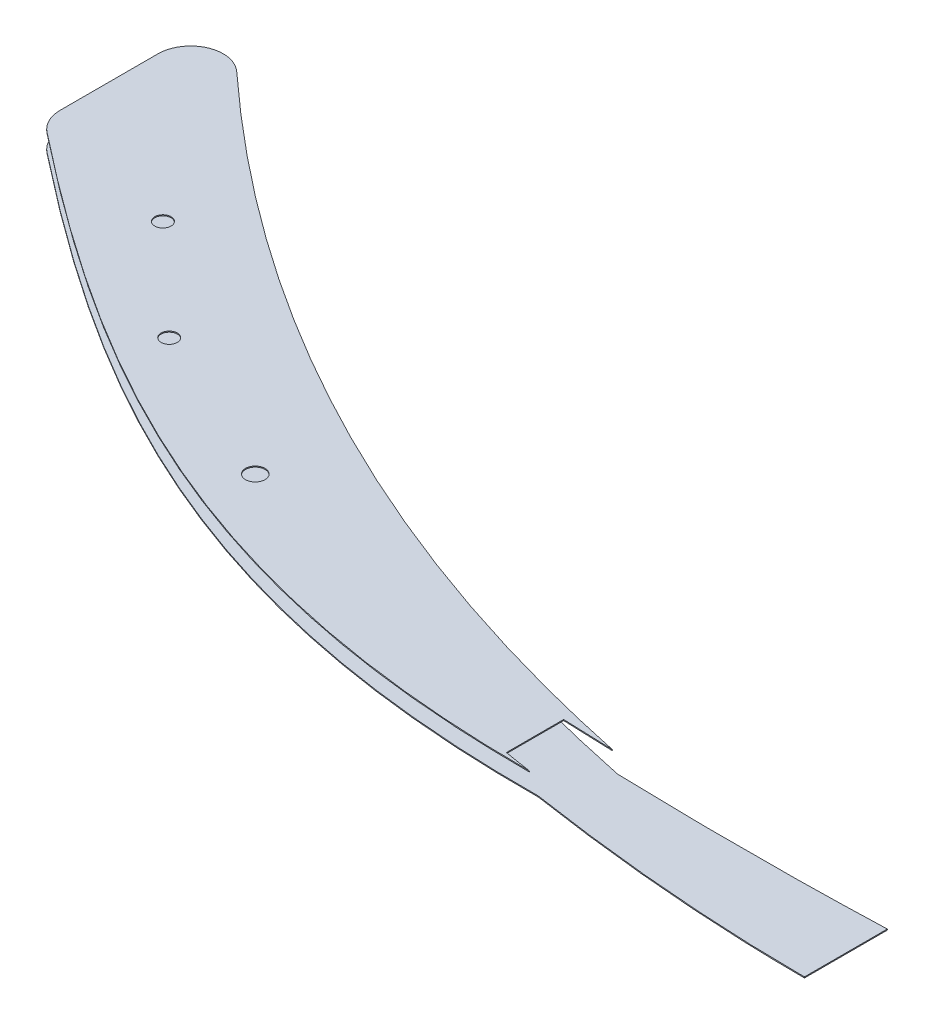
ISO-10303-21;
HEADER;
FILE_DESCRIPTION(('STEP AP214'),'2;1');
FILE_NAME('part.step','',(''),(''),'','','');
FILE_SCHEMA(('AUTOMOTIVE_DESIGN { 1 0 10303 214 1 1 1 1 }'));
ENDSEC;
DATA;
#1=APPLICATION_CONTEXT('core data for automotive mechanical design processes');
#2=APPLICATION_PROTOCOL_DEFINITION('international standard','automotive_design',2000,#1);
#3=PRODUCT_CONTEXT('',#1,'mechanical');
#4=PRODUCT('Part','Part','',(#3));
#5=PRODUCT_RELATED_PRODUCT_CATEGORY('part','',(#4));
#6=PRODUCT_DEFINITION_FORMATION('','',#4);
#7=PRODUCT_DEFINITION_CONTEXT('part definition',#1,'design');
#8=PRODUCT_DEFINITION('design','',#6,#7);
#9=PRODUCT_DEFINITION_SHAPE('','',#8);
#10=(LENGTH_UNIT() NAMED_UNIT(*) SI_UNIT(.MILLI.,.METRE.));
#11=(NAMED_UNIT(*) PLANE_ANGLE_UNIT() SI_UNIT($,.RADIAN.));
#12=(NAMED_UNIT(*) SI_UNIT($,.STERADIAN.) SOLID_ANGLE_UNIT());
#13=UNCERTAINTY_MEASURE_WITH_UNIT(LENGTH_MEASURE(1.E-05),#10,'distance_accuracy_value','');
#14=(GEOMETRIC_REPRESENTATION_CONTEXT(3) GLOBAL_UNCERTAINTY_ASSIGNED_CONTEXT((#13)) GLOBAL_UNIT_ASSIGNED_CONTEXT((#10,
#11,#12)) REPRESENTATION_CONTEXT('',''));
#15=CARTESIAN_POINT('',(0.,0.,0.));
#16=DIRECTION('',(0.,0.,1.));
#17=DIRECTION('',(1.,0.,0.));
#18=AXIS2_PLACEMENT_3D('',#15,#16,#17);
#19=CARTESIAN_POINT('',(-399.451682503824,300.3,-386.496425626492));
#20=CARTESIAN_POINT('',(-331.649658003381,300.3,-324.043622454853));
#21=CARTESIAN_POINT('',(-251.845093079777,300.3,-282.915553356741));
#22=CARTESIAN_POINT('',(-161.60969154118,300.3,-263.964054369405));
#23=B_SPLINE_CURVE_WITH_KNOTS('',3,(#19,#20,#21,#22),.UNSPECIFIED.,.F.,.F.,(4,4),(0.,
0.857945261881802),.UNSPECIFIED.);
#24=DIRECTION('',(0.,-1.,0.));
#25=VECTOR('',#24,1.);
#26=SURFACE_OF_LINEAR_EXTRUSION('',#23,#25);
#27=CARTESIAN_POINT('',(-161.60969154118,300.,-263.964054369405));
#28=CARTESIAN_POINT('',(-251.845093079777,300.,-282.915553356741));
#29=CARTESIAN_POINT('',(-331.649658003381,300.,-324.043622454853));
#30=CARTESIAN_POINT('',(-399.451682503824,300.,-386.496425626492));
#31=B_SPLINE_CURVE_WITH_KNOTS('',3,(#27,#28,#29,#30),.UNSPECIFIED.,.F.,.F.,(4,4),(0.,
0.857945261881802),.UNSPECIFIED.);
#32=CARTESIAN_POINT('',(-399.451682503824,300.,-386.496425626493));
#33=VERTEX_POINT('',#32);
#34=CARTESIAN_POINT('',(-161.609691541186,300.,-263.964054369406));
#35=VERTEX_POINT('',#34);
#36=EDGE_CURVE('E302',#33,#35,#31,.F.);
#37=ORIENTED_EDGE('',*,*,#36,.F.);
#38=DIRECTION('',(0.,-1.,0.));
#39=VECTOR('',#38,1.);
#40=CARTESIAN_POINT('',(-399.451682503824,300.3,-386.496425626493));
#41=LINE('',#40,#39);
#42=CARTESIAN_POINT('',(-399.451682503824,300.3,-386.496425626493));
#43=VERTEX_POINT('',#42);
#44=EDGE_CURVE('E189',#43,#33,#41,.T.);
#45=ORIENTED_EDGE('',*,*,#44,.F.);
#46=CARTESIAN_POINT('',(-399.451682503824,300.3,-386.496425626492));
#47=CARTESIAN_POINT('',(-331.649658003381,300.3,-324.043622454853));
#48=CARTESIAN_POINT('',(-251.845093079777,300.3,-282.915553356741));
#49=CARTESIAN_POINT('',(-161.60969154118,300.3,-263.964054369405));
#50=B_SPLINE_CURVE_WITH_KNOTS('',3,(#46,#47,#48,#49),.UNSPECIFIED.,.F.,.F.,(4,4),(0.,
0.857945261881802),.UNSPECIFIED.);
#51=CARTESIAN_POINT('',(-161.609691541186,300.3,-263.964054369406));
#52=VERTEX_POINT('',#51);
#53=EDGE_CURVE('E274',#43,#52,#50,.T.);
#54=ORIENTED_EDGE('',*,*,#53,.T.);
#55=DIRECTION('',(0.,-1.,0.));
#56=VECTOR('',#55,1.);
#57=CARTESIAN_POINT('',(-161.609691541186,300.3,-263.964054369406));
#58=LINE('',#57,#56);
#59=EDGE_CURVE('E12',#52,#35,#58,.T.);
#60=ORIENTED_EDGE('',*,*,#59,.T.);
#61=EDGE_LOOP('',(#37,#45,#54,#60));
#62=FACE_BOUND('',#61,.T.);
#63=ADVANCED_FACE('F47',(#62),#26,.T.);
#64=CARTESIAN_POINT('',(-161.609691541186,300.3,-263.964054369406));
#65=CARTESIAN_POINT('',(-163.461784935838,300.3,-264.018551283324));
#66=CARTESIAN_POINT('',(-167.684740985381,300.3,-264.151245151058));
#67=CARTESIAN_POINT('',(-172.876910079493,300.3,-264.337762118416));
#68=CARTESIAN_POINT('',(-176.217014144586,300.3,-264.469751133429));
#69=CARTESIAN_POINT('',(-177.187477809245,300.3,-264.509119585318));
#70=B_SPLINE_CURVE_WITH_KNOTS('',3,(#64,#65,#66,#67,#68,#69),.UNSPECIFIED.,.F.,.F.,(4,1,1,4),
(0.455950291136743,0.480354949034344,0.511604949034344,0.524404657897601),.UNSPECIFIED.);
#71=DIRECTION('',(0.,-1.,0.));
#72=VECTOR('',#71,1.);
#73=SURFACE_OF_LINEAR_EXTRUSION('',#70,#72);
#74=CARTESIAN_POINT('',(-177.187477809245,300.,-264.509119585318));
#75=CARTESIAN_POINT('',(-176.217014144586,300.,-264.469751133429));
#76=CARTESIAN_POINT('',(-172.876910079493,300.,-264.337762118416));
#77=CARTESIAN_POINT('',(-167.684740985381,300.,-264.151245151058));
#78=CARTESIAN_POINT('',(-163.461784935838,300.,-264.018551283324));
#79=CARTESIAN_POINT('',(-161.609691541186,300.,-263.964054369406));
#80=B_SPLINE_CURVE_WITH_KNOTS('',3,(#74,#75,#76,#77,#78,#79),.UNSPECIFIED.,.F.,.F.,(4,1,1,4),
(0.455950291136743,0.46875,0.5,0.524404657897601),.UNSPECIFIED.);
#81=CARTESIAN_POINT('',(-177.187477809245,300.,-264.509119585318));
#82=VERTEX_POINT('',#81);
#83=EDGE_CURVE('E259',#35,#82,#80,.F.);
#84=ORIENTED_EDGE('',*,*,#83,.F.);
#85=ORIENTED_EDGE('',*,*,#59,.F.);
#86=CARTESIAN_POINT('',(-161.609691541186,300.3,-263.964054369406));
#87=CARTESIAN_POINT('',(-163.461784935838,300.3,-264.018551283324));
#88=CARTESIAN_POINT('',(-167.684740985381,300.3,-264.151245151058));
#89=CARTESIAN_POINT('',(-172.876910079493,300.3,-264.337762118416));
#90=CARTESIAN_POINT('',(-176.217014144586,300.3,-264.469751133429));
#91=CARTESIAN_POINT('',(-177.187477809245,300.3,-264.509119585318));
#92=B_SPLINE_CURVE_WITH_KNOTS('',3,(#86,#87,#88,#89,#90,#91),.UNSPECIFIED.,.F.,.F.,(4,1,1,4),
(0.455950291136743,0.480354949034344,0.511604949034344,0.524404657897601),.UNSPECIFIED.);
#93=CARTESIAN_POINT('',(-177.187477809245,300.3,-264.509119585318));
#94=VERTEX_POINT('',#93);
#95=EDGE_CURVE('E105',#52,#94,#92,.T.);
#96=ORIENTED_EDGE('',*,*,#95,.T.);
#97=DIRECTION('',(0.,-1.,0.));
#98=VECTOR('',#97,1.);
#99=CARTESIAN_POINT('',(-177.187477809245,300.3,-264.509119585318));
#100=LINE('',#99,#98);
#101=EDGE_CURVE('E58',#94,#82,#100,.T.);
#102=ORIENTED_EDGE('',*,*,#101,.T.);
#103=EDGE_LOOP('',(#84,#85,#96,#102));
#104=FACE_BOUND('',#103,.T.);
#105=ADVANCED_FACE('F235',(#104),#73,.T.);
#106=CARTESIAN_POINT('',(-177.187477809245,300.3,-264.509119585318));
#107=DIRECTION('',(-1.,0.,0.));
#108=DIRECTION('',(0.,0.,-1.));
#109=AXIS2_PLACEMENT_3D('',#106,#107,#108);
#110=PLANE('',#109);
#111=DIRECTION('',(0.,0.,1.));
#112=VECTOR('',#111,1.);
#113=CARTESIAN_POINT('',(-177.187477809245,300.,-264.509119585318));
#114=LINE('',#113,#112);
#115=CARTESIAN_POINT('',(-177.187477809245,300.,-246.945846167666));
#116=VERTEX_POINT('',#115);
#117=EDGE_CURVE('E263',#82,#116,#114,.T.);
#118=ORIENTED_EDGE('',*,*,#117,.F.);
#119=ORIENTED_EDGE('',*,*,#101,.F.);
#120=DIRECTION('',(0.,0.,1.));
#121=VECTOR('',#120,1.);
#122=CARTESIAN_POINT('',(-177.187477809245,300.3,-264.509119585318));
#123=LINE('',#122,#121);
#124=CARTESIAN_POINT('',(-177.187477809245,300.3,-246.945846167666));
#125=VERTEX_POINT('',#124);
#126=EDGE_CURVE('E459',#94,#125,#123,.T.);
#127=ORIENTED_EDGE('',*,*,#126,.T.);
#128=DIRECTION('',(0.,-1.,0.));
#129=VECTOR('',#128,1.);
#130=CARTESIAN_POINT('',(-177.187477809245,300.3,-246.945846167666));
#131=LINE('',#130,#129);
#132=EDGE_CURVE('E191',#125,#116,#131,.T.);
#133=ORIENTED_EDGE('',*,*,#132,.T.);
#134=EDGE_LOOP('',(#118,#119,#127,#133));
#135=FACE_BOUND('',#134,.T.);
#136=ADVANCED_FACE('F243',(#135),#110,.F.);
#137=CARTESIAN_POINT('',(-62.2203477872149,300.3,-937.449704542469));
#138=DIRECTION('',(0.,-1.,0.));
#139=DIRECTION('',(0.,0.,1.));
#140=AXIS2_PLACEMENT_3D('',#137,#138,#139);
#141=CYLINDRICAL_SURFACE('',#140,700.00929952108);
#142=CARTESIAN_POINT('',(-62.2203477872149,300.,-937.449704542469));
#143=DIRECTION('',(0.,1.,0.));
#144=DIRECTION('',(0.,0.,-1.));
#145=AXIS2_PLACEMENT_3D('',#142,#143,#144);
#146=CIRCLE('',#145,700.00929952108);
#147=CARTESIAN_POINT('',(-168.766510620738,300.,-245.596443654407));
#148=VERTEX_POINT('',#147);
#149=EDGE_CURVE('E270',#116,#148,#146,.T.);
#150=ORIENTED_EDGE('',*,*,#149,.F.);
#151=ORIENTED_EDGE('',*,*,#132,.F.);
#152=CARTESIAN_POINT('',(-62.2203477872149,300.3,-937.449704542469));
#153=DIRECTION('',(0.,1.,0.));
#154=DIRECTION('',(0.,0.,-1.));
#155=AXIS2_PLACEMENT_3D('',#152,#153,#154);
#156=CIRCLE('',#155,700.00929952108);
#157=CARTESIAN_POINT('',(-168.766510620738,300.3,-245.596443654407));
#158=VERTEX_POINT('',#157);
#159=EDGE_CURVE('E142',#125,#158,#156,.T.);
#160=ORIENTED_EDGE('',*,*,#159,.T.);
#161=DIRECTION('',(0.,-1.,0.));
#162=VECTOR('',#161,1.);
#163=CARTESIAN_POINT('',(-168.766510620738,300.3,-245.596443654407));
#164=LINE('',#163,#162);
#165=EDGE_CURVE('E194',#158,#148,#164,.T.);
#166=ORIENTED_EDGE('',*,*,#165,.T.);
#167=EDGE_LOOP('',(#150,#151,#160,#166));
#168=FACE_BOUND('',#167,.T.);
#169=ADVANCED_FACE('F171',(#168),#141,.F.);
#170=CARTESIAN_POINT('',(-168.766510620738,300.3,-245.596443654407));
#171=CARTESIAN_POINT('',(-269.905820359368,300.3,-245.400566452578));
#172=CARTESIAN_POINT('',(-338.225722808998,300.3,-282.722388214947));
#173=CARTESIAN_POINT('',(-412.421480502429,300.3,-341.273256936095));
#174=B_SPLINE_CURVE_WITH_KNOTS('',3,(#170,#171,#172,#173),.UNSPECIFIED.,.F.,.F.,(4,4),
(0.0849051691132969,0.984590409608373),.UNSPECIFIED.);
#175=DIRECTION('',(0.,-1.,0.));
#176=VECTOR('',#175,1.);
#177=SURFACE_OF_LINEAR_EXTRUSION('',#174,#176);
#178=CARTESIAN_POINT('',(-412.421480502429,300.,-341.273256936095));
#179=CARTESIAN_POINT('',(-338.225722808998,300.,-282.722388214947));
#180=CARTESIAN_POINT('',(-269.905820359368,300.,-245.400566452578));
#181=CARTESIAN_POINT('',(-168.766510620738,300.,-245.596443654407));
#182=B_SPLINE_CURVE_WITH_KNOTS('',3,(#178,#179,#180,#181),.UNSPECIFIED.,.F.,.F.,(4,4),
(0.0849051691132969,0.984590409608373),.UNSPECIFIED.);
#183=CARTESIAN_POINT('',(-412.421480502429,300.,-341.273256936095));
#184=VERTEX_POINT('',#183);
#185=EDGE_CURVE('E153',#148,#184,#182,.F.);
#186=ORIENTED_EDGE('',*,*,#185,.F.);
#187=ORIENTED_EDGE('',*,*,#165,.F.);
#188=CARTESIAN_POINT('',(-168.766510620738,300.3,-245.596443654407));
#189=CARTESIAN_POINT('',(-269.905820359368,300.3,-245.400566452578));
#190=CARTESIAN_POINT('',(-338.225722808998,300.3,-282.722388214947));
#191=CARTESIAN_POINT('',(-412.421480502429,300.3,-341.273256936095));
#192=B_SPLINE_CURVE_WITH_KNOTS('',3,(#188,#189,#190,#191),.UNSPECIFIED.,.F.,.F.,(4,4),
(0.0849051691132969,0.984590409608373),.UNSPECIFIED.);
#193=CARTESIAN_POINT('',(-412.421480502429,300.3,-341.273256936095));
#194=VERTEX_POINT('',#193);
#195=EDGE_CURVE('E140',#158,#194,#192,.T.);
#196=ORIENTED_EDGE('',*,*,#195,.T.);
#197=DIRECTION('',(0.,-1.,0.));
#198=VECTOR('',#197,1.);
#199=CARTESIAN_POINT('',(-412.421480502429,300.3,-341.273256936095));
#200=LINE('',#199,#198);
#201=EDGE_CURVE('E134',#194,#184,#200,.T.);
#202=ORIENTED_EDGE('',*,*,#201,.T.);
#203=EDGE_LOOP('',(#186,#187,#196,#202));
#204=FACE_BOUND('',#203,.T.);
#205=ADVANCED_FACE('F160',(#204),#177,.T.);
#206=CARTESIAN_POINT('',(-406.226649581238,300.3,-349.123356926404));
#207=DIRECTION('',(0.,-1.,0.));
#208=DIRECTION('',(0.,0.,1.));
#209=AXIS2_PLACEMENT_3D('',#206,#207,#208);
#210=CYLINDRICAL_SURFACE('',#209,9.99999999999995);
#211=CARTESIAN_POINT('',(-406.226649581238,300.,-349.123356926404));
#212=DIRECTION('',(0.,-1.,0.));
#213=DIRECTION('',(0.,0.,-1.));
#214=AXIS2_PLACEMENT_3D('',#211,#212,#213);
#215=CIRCLE('',#214,9.99999999999995);
#216=CARTESIAN_POINT('',(-416.226649581238,300.,-349.123356926403));
#217=VERTEX_POINT('',#216);
#218=EDGE_CURVE('E188',#184,#217,#215,.T.);
#219=ORIENTED_EDGE('',*,*,#218,.F.);
#220=ORIENTED_EDGE('',*,*,#201,.F.);
#221=CARTESIAN_POINT('',(-406.226649581238,300.3,-349.123356926404));
#222=DIRECTION('',(0.,-1.,0.));
#223=DIRECTION('',(0.,0.,-1.));
#224=AXIS2_PLACEMENT_3D('',#221,#222,#223);
#225=CIRCLE('',#224,9.99999999999995);
#226=CARTESIAN_POINT('',(-416.226649581238,300.3,-349.123356926403));
#227=VERTEX_POINT('',#226);
#228=EDGE_CURVE('E124',#194,#227,#225,.T.);
#229=ORIENTED_EDGE('',*,*,#228,.T.);
#230=DIRECTION('',(0.,-1.,0.));
#231=VECTOR('',#230,1.);
#232=CARTESIAN_POINT('',(-416.226649581238,300.3,-349.123356926403));
#233=LINE('',#232,#231);
#234=EDGE_CURVE('E129',#227,#217,#233,.T.);
#235=ORIENTED_EDGE('',*,*,#234,.T.);
#236=EDGE_LOOP('',(#219,#220,#229,#235));
#237=FACE_BOUND('',#236,.T.);
#238=ADVANCED_FACE('F137',(#237),#210,.T.);
#239=CARTESIAN_POINT('',(-416.226649581238,300.3,-349.123356926403));
#240=DIRECTION('',(1.,0.,0.));
#241=DIRECTION('',(0.,0.,1.));
#242=AXIS2_PLACEMENT_3D('',#239,#240,#241);
#243=PLANE('',#242);
#244=DIRECTION('',(0.,0.,-1.));
#245=VECTOR('',#244,1.);
#246=CARTESIAN_POINT('',(-416.226649581238,300.,-349.123356926403));
#247=LINE('',#246,#245);
#248=CARTESIAN_POINT('',(-416.226649581238,300.,-379.14116756848));
#249=VERTEX_POINT('',#248);
#250=EDGE_CURVE('E131',#217,#249,#247,.T.);
#251=ORIENTED_EDGE('',*,*,#250,.F.);
#252=ORIENTED_EDGE('',*,*,#234,.F.);
#253=DIRECTION('',(0.,0.,-1.));
#254=VECTOR('',#253,1.);
#255=CARTESIAN_POINT('',(-416.226649581238,300.3,-349.123356926403));
#256=LINE('',#255,#254);
#257=CARTESIAN_POINT('',(-416.226649581238,300.3,-379.14116756848));
#258=VERTEX_POINT('',#257);
#259=EDGE_CURVE('E120',#227,#258,#256,.T.);
#260=ORIENTED_EDGE('',*,*,#259,.T.);
#261=DIRECTION('',(0.,-1.,0.));
#262=VECTOR('',#261,1.);
#263=CARTESIAN_POINT('',(-416.226649581238,300.3,-379.14116756848));
#264=LINE('',#263,#262);
#265=EDGE_CURVE('E135',#258,#249,#264,.T.);
#266=ORIENTED_EDGE('',*,*,#265,.T.);
#267=EDGE_LOOP('',(#251,#252,#260,#266));
#268=FACE_BOUND('',#267,.T.);
#269=ADVANCED_FACE('F130',(#268),#243,.F.);
#270=CARTESIAN_POINT('',(-406.226649581238,300.3,-379.14116756848));
#271=DIRECTION('',(0.,-1.,0.));
#272=DIRECTION('',(0.,0.,1.));
#273=AXIS2_PLACEMENT_3D('',#270,#271,#272);
#274=CYLINDRICAL_SURFACE('',#273,10.);
#275=CARTESIAN_POINT('',(-406.226649581238,300.,-379.14116756848));
#276=DIRECTION('',(0.,-1.,0.));
#277=DIRECTION('',(0.,0.,-1.));
#278=AXIS2_PLACEMENT_3D('',#275,#276,#277);
#279=CIRCLE('',#278,10.);
#280=EDGE_CURVE('E93',#249,#33,#279,.T.);
#281=ORIENTED_EDGE('',*,*,#280,.F.);
#282=ORIENTED_EDGE('',*,*,#265,.F.);
#283=CARTESIAN_POINT('',(-406.226649581238,300.3,-379.14116756848));
#284=DIRECTION('',(0.,-1.,0.));
#285=DIRECTION('',(0.,0.,-1.));
#286=AXIS2_PLACEMENT_3D('',#283,#284,#285);
#287=CIRCLE('',#286,10.);
#288=EDGE_CURVE('E67',#258,#43,#287,.T.);
#289=ORIENTED_EDGE('',*,*,#288,.T.);
#290=ORIENTED_EDGE('',*,*,#44,.T.);
#291=EDGE_LOOP('',(#281,#282,#289,#290));
#292=FACE_BOUND('',#291,.T.);
#293=ADVANCED_FACE('F210',(#292),#274,.T.);
#294=CARTESIAN_POINT('',(-288.94320341181,300.3,-308.917250928835));
#295=DIRECTION('',(0.,1.,0.));
#296=DIRECTION('',(0.,0.,-1.));
#297=AXIS2_PLACEMENT_3D('',#294,#295,#296);
#298=PLANE('',#297);
#299=CARTESIAN_POINT('',(-370.956911026411,300.3,-335.367132453118));
#300=DIRECTION('',(0.,-1.,0.));
#301=DIRECTION('',(0.,0.,-1.));
#302=AXIS2_PLACEMENT_3D('',#299,#300,#301);
#303=CIRCLE('',#302,2.50000000000002);
#304=CARTESIAN_POINT('',(-370.956911026411,300.3,-337.867132453118));
#305=VERTEX_POINT('',#304);
#306=EDGE_CURVE('E326',#305,#305,#303,.T.);
#307=ORIENTED_EDGE('',*,*,#306,.T.);
#308=EDGE_LOOP('',(#307));
#309=FACE_BOUND('',#308,.T.);
#310=CARTESIAN_POINT('',(-339.082998520851,300.3,-305.429754445409));
#311=DIRECTION('',(0.,-1.,0.));
#312=DIRECTION('',(0.,0.,-1.));
#313=AXIS2_PLACEMENT_3D('',#310,#311,#312);
#314=CIRCLE('',#313,2.50000000000002);
#315=CARTESIAN_POINT('',(-339.082998520851,300.3,-307.929754445409));
#316=VERTEX_POINT('',#315);
#317=EDGE_CURVE('E419',#316,#316,#314,.T.);
#318=ORIENTED_EDGE('',*,*,#317,.T.);
#319=EDGE_LOOP('',(#318));
#320=FACE_BOUND('',#319,.T.);
#321=CARTESIAN_POINT('',(-289.687055909534,300.3,-282.424125212571));
#322=DIRECTION('',(0.,-1.,0.));
#323=DIRECTION('',(0.,0.,-1.));
#324=AXIS2_PLACEMENT_3D('',#321,#322,#323);
#325=CIRCLE('',#324,2.99999999999999);
#326=CARTESIAN_POINT('',(-289.687055909534,300.3,-285.424125212571));
#327=VERTEX_POINT('',#326);
#328=EDGE_CURVE('E422',#327,#327,#325,.T.);
#329=ORIENTED_EDGE('',*,*,#328,.T.);
#330=EDGE_LOOP('',(#329));
#331=FACE_BOUND('',#330,.T.);
#332=ORIENTED_EDGE('',*,*,#53,.F.);
#333=ORIENTED_EDGE('',*,*,#288,.F.);
#334=ORIENTED_EDGE('',*,*,#259,.F.);
#335=ORIENTED_EDGE('',*,*,#228,.F.);
#336=ORIENTED_EDGE('',*,*,#195,.F.);
#337=ORIENTED_EDGE('',*,*,#159,.F.);
#338=ORIENTED_EDGE('',*,*,#126,.F.);
#339=ORIENTED_EDGE('',*,*,#95,.F.);
#340=EDGE_LOOP('',(#332,#333,#334,#335,#336,#337,#338,#339));
#341=FACE_BOUND('',#340,.T.);
#342=ADVANCED_FACE('F122',(#309,#320,#331,#341),#298,.T.);
#343=CARTESIAN_POINT('',(-288.94320341181,300.,-308.917250928835));
#344=DIRECTION('',(0.,1.,0.));
#345=DIRECTION('',(0.,0.,-1.));
#346=AXIS2_PLACEMENT_3D('',#343,#344,#345);
#347=PLANE('',#346);
#348=CARTESIAN_POINT('',(-370.956911026411,300.,-335.367132453118));
#349=DIRECTION('',(0.,-1.,0.));
#350=DIRECTION('',(0.,0.,-1.));
#351=AXIS2_PLACEMENT_3D('',#348,#349,#350);
#352=CIRCLE('',#351,2.50000000000002);
#353=CARTESIAN_POINT('',(-370.956911026411,300.,-337.867132453118));
#354=VERTEX_POINT('',#353);
#355=EDGE_CURVE('E52',#354,#354,#352,.T.);
#356=ORIENTED_EDGE('',*,*,#355,.F.);
#357=EDGE_LOOP('',(#356));
#358=FACE_BOUND('',#357,.T.);
#359=CARTESIAN_POINT('',(-339.082998520851,300.,-305.429754445409));
#360=DIRECTION('',(0.,-1.,0.));
#361=DIRECTION('',(0.,0.,-1.));
#362=AXIS2_PLACEMENT_3D('',#359,#360,#361);
#363=CIRCLE('',#362,2.50000000000002);
#364=CARTESIAN_POINT('',(-339.082998520851,300.,-307.929754445409));
#365=VERTEX_POINT('',#364);
#366=EDGE_CURVE('E325',#365,#365,#363,.T.);
#367=ORIENTED_EDGE('',*,*,#366,.F.);
#368=EDGE_LOOP('',(#367));
#369=FACE_BOUND('',#368,.T.);
#370=CARTESIAN_POINT('',(-289.687055909534,300.,-282.424125212571));
#371=DIRECTION('',(0.,-1.,0.));
#372=DIRECTION('',(0.,0.,-1.));
#373=AXIS2_PLACEMENT_3D('',#370,#371,#372);
#374=CIRCLE('',#373,2.99999999999999);
#375=CARTESIAN_POINT('',(-289.687055909534,300.,-285.424125212571));
#376=VERTEX_POINT('',#375);
#377=EDGE_CURVE('E323',#376,#376,#374,.T.);
#378=ORIENTED_EDGE('',*,*,#377,.F.);
#379=EDGE_LOOP('',(#378));
#380=FACE_BOUND('',#379,.T.);
#381=ORIENTED_EDGE('',*,*,#36,.T.);
#382=ORIENTED_EDGE('',*,*,#83,.T.);
#383=ORIENTED_EDGE('',*,*,#117,.T.);
#384=ORIENTED_EDGE('',*,*,#149,.T.);
#385=ORIENTED_EDGE('',*,*,#185,.T.);
#386=ORIENTED_EDGE('',*,*,#218,.T.);
#387=ORIENTED_EDGE('',*,*,#250,.T.);
#388=ORIENTED_EDGE('',*,*,#280,.T.);
#389=EDGE_LOOP('',(#381,#382,#383,#384,#385,#386,#387,#388));
#390=FACE_BOUND('',#389,.T.);
#391=ADVANCED_FACE('F209',(#358,#369,#380,#390),#347,.F.);
#392=CARTESIAN_POINT('',(-289.687055909534,288.3,-282.424125212571));
#393=DIRECTION('',(0.,1.,0.));
#394=DIRECTION('',(0.,0.,-1.));
#395=AXIS2_PLACEMENT_3D('',#392,#393,#394);
#396=CYLINDRICAL_SURFACE('',#395,2.99999999999999);
#397=ORIENTED_EDGE('',*,*,#328,.F.);
#398=EDGE_LOOP('',(#397));
#399=FACE_BOUND('',#398,.T.);
#400=ORIENTED_EDGE('',*,*,#377,.T.);
#401=EDGE_LOOP('',(#400));
#402=FACE_BOUND('',#401,.T.);
#403=ADVANCED_FACE('F212',(#399,#402),#396,.F.);
#404=CARTESIAN_POINT('',(-339.082998520851,288.3,-305.429754445409));
#405=DIRECTION('',(0.,1.,0.));
#406=DIRECTION('',(0.,0.,-1.));
#407=AXIS2_PLACEMENT_3D('',#404,#405,#406);
#408=CYLINDRICAL_SURFACE('',#407,2.50000000000002);
#409=ORIENTED_EDGE('',*,*,#317,.F.);
#410=EDGE_LOOP('',(#409));
#411=FACE_BOUND('',#410,.T.);
#412=ORIENTED_EDGE('',*,*,#366,.T.);
#413=EDGE_LOOP('',(#412));
#414=FACE_BOUND('',#413,.T.);
#415=ADVANCED_FACE('F341',(#411,#414),#408,.F.);
#416=CARTESIAN_POINT('',(-370.956911026411,288.3,-335.367132453118));
#417=DIRECTION('',(0.,1.,0.));
#418=DIRECTION('',(0.,0.,-1.));
#419=AXIS2_PLACEMENT_3D('',#416,#417,#418);
#420=CYLINDRICAL_SURFACE('',#419,2.50000000000002);
#421=ORIENTED_EDGE('',*,*,#306,.F.);
#422=EDGE_LOOP('',(#421));
#423=FACE_BOUND('',#422,.T.);
#424=ORIENTED_EDGE('',*,*,#355,.T.);
#425=EDGE_LOOP('',(#424));
#426=FACE_BOUND('',#425,.T.);
#427=ADVANCED_FACE('F333',(#423,#426),#420,.F.);
#428=CLOSED_SHELL('',(#63,#105,#136,#169,#205,#238,#269,#293,#342,#391,#403,#415,#427));
#429=MANIFOLD_SOLID_BREP('B2',#428);
#430=CARTESIAN_POINT('',(-412.421480502429,294.7,-341.273256936095));
#431=CARTESIAN_POINT('',(-337.562441747407,294.7,-282.19896634327));
#432=CARTESIAN_POINT('',(-268.684783511191,294.7,-244.734978020227));
#433=CARTESIAN_POINT('',(-166.046176884714,294.7,-245.610703349975));
#434=B_SPLINE_CURVE_WITH_KNOTS('',3,(#430,#431,#432,#433),.UNSPECIFIED.,.F.,.F.,(4,4),
(0.0768623348601792,0.984590409608373),.UNSPECIFIED.);
#435=DIRECTION('',(0.,1.,0.));
#436=VECTOR('',#435,1.);
#437=SURFACE_OF_LINEAR_EXTRUSION('',#434,#436);
#438=CARTESIAN_POINT('',(-412.421480502429,295.,-341.273256936095));
#439=CARTESIAN_POINT('',(-337.562441747407,295.,-282.19896634327));
#440=CARTESIAN_POINT('',(-268.684783511191,295.,-244.734978020227));
#441=CARTESIAN_POINT('',(-166.046176884714,295.,-245.610703349975));
#442=B_SPLINE_CURVE_WITH_KNOTS('',3,(#438,#439,#440,#441),.UNSPECIFIED.,.F.,.F.,(4,4),
(0.0768623348601792,0.984590409608373),.UNSPECIFIED.);
#443=CARTESIAN_POINT('',(-412.421480502429,295.,-341.273256936095));
#444=VERTEX_POINT('',#443);
#445=CARTESIAN_POINT('',(-166.046176884714,295.,-245.610703349975));
#446=VERTEX_POINT('',#445);
#447=EDGE_CURVE('E749',#444,#446,#442,.T.);
#448=ORIENTED_EDGE('',*,*,#447,.F.);
#449=DIRECTION('',(0.,1.,0.));
#450=VECTOR('',#449,1.);
#451=CARTESIAN_POINT('',(-412.421480502429,294.7,-341.273256936095));
#452=LINE('',#451,#450);
#453=CARTESIAN_POINT('',(-412.421480502429,294.7,-341.273256936095));
#454=VERTEX_POINT('',#453);
#455=EDGE_CURVE('E602',#454,#444,#452,.T.);
#456=ORIENTED_EDGE('',*,*,#455,.F.);
#457=CARTESIAN_POINT('',(-166.046176884714,294.7,-245.610703349975));
#458=VERTEX_POINT('',#457);
#459=EDGE_CURVE('E608',#454,#458,#434,.T.);
#460=ORIENTED_EDGE('',*,*,#459,.T.);
#461=DIRECTION('',(0.,1.,0.));
#462=VECTOR('',#461,1.);
#463=CARTESIAN_POINT('',(-166.046176884714,294.7,-245.610703349975));
#464=LINE('',#463,#462);
#465=EDGE_CURVE('E45',#458,#446,#464,.T.);
#466=ORIENTED_EDGE('',*,*,#465,.T.);
#467=EDGE_LOOP('',(#448,#456,#460,#466));
#468=FACE_BOUND('',#467,.T.);
#469=ADVANCED_FACE('F499',(#468),#437,.T.);
#470=CARTESIAN_POINT('',(-166.046176884714,294.7,-245.610703349975));
#471=CARTESIAN_POINT('',(-158.691588185936,294.7,-244.479612696359));
#472=CARTESIAN_POINT('',(-151.319796635798,294.7,-243.468209687689));
#473=CARTESIAN_POINT('',(-136.557675167849,294.7,-241.699121011541));
#474=CARTESIAN_POINT('',(-129.16508875455,294.7,-240.940959884745));
#475=CARTESIAN_POINT('',(-114.354878372138,294.7,-239.699183418636));
#476=CARTESIAN_POINT('',(-106.937301857712,294.7,-239.215047721649));
#477=CARTESIAN_POINT('',(-95.7901021433856,294.7,-238.717306802063));
#478=CARTESIAN_POINT('',(-92.0700558776784,294.7,-238.589825858461));
#479=CARTESIAN_POINT('',(-84.6298578500282,294.7,-238.417469405935));
#480=CARTESIAN_POINT('',(-80.9090479891768,294.7,-238.372473535805));
#481=CARTESIAN_POINT('',(-77.187477809136,294.7,-238.371526152161));
#482=B_SPLINE_CURVE_WITH_KNOTS('',3,(#470,#471,#472,#473,#474,#475,#476,#477,#478,#479,#480,
#481),.UNSPECIFIED.,.F.,.F.,(4,2,2,2,2,4),(0.,0.25,0.5,0.75,0.875,1.),.UNSPECIFIED.);
#483=DIRECTION('',(0.,1.,0.));
#484=VECTOR('',#483,1.);
#485=SURFACE_OF_LINEAR_EXTRUSION('',#482,#484);
#486=CARTESIAN_POINT('',(-77.187477809136,295.,-238.371526152161));
#487=CARTESIAN_POINT('',(-80.9090479891768,295.,-238.372473535805));
#488=CARTESIAN_POINT('',(-84.6298578500282,295.,-238.417469405935));
#489=CARTESIAN_POINT('',(-92.0700558776784,295.,-238.589825858461));
#490=CARTESIAN_POINT('',(-95.7901021433856,295.,-238.717306802063));
#491=CARTESIAN_POINT('',(-106.937301857712,295.,-239.215047721649));
#492=CARTESIAN_POINT('',(-114.354878372138,295.,-239.699183418636));
#493=CARTESIAN_POINT('',(-129.16508875455,295.,-240.940959884745));
#494=CARTESIAN_POINT('',(-136.557675167849,295.,-241.699121011541));
#495=CARTESIAN_POINT('',(-151.319796635798,295.,-243.468209687689));
#496=CARTESIAN_POINT('',(-158.691588185936,295.,-244.479612696359));
#497=CARTESIAN_POINT('',(-166.046176884714,295.,-245.610703349975));
#498=B_SPLINE_CURVE_WITH_KNOTS('',3,(#486,#487,#488,#489,#490,#491,#492,#493,#494,#495,#496,
#497),.UNSPECIFIED.,.F.,.F.,(4,2,2,2,2,4),(0.,0.125,0.25,0.5,0.75,1.),.UNSPECIFIED.);
#499=CARTESIAN_POINT('',(-77.187477809136,295.,-238.371526152161));
#500=VERTEX_POINT('',#499);
#501=EDGE_CURVE('E719',#446,#500,#498,.F.);
#502=ORIENTED_EDGE('',*,*,#501,.F.);
#503=ORIENTED_EDGE('',*,*,#465,.F.);
#504=CARTESIAN_POINT('',(-166.046176884714,294.7,-245.610703349975));
#505=CARTESIAN_POINT('',(-158.691588185936,294.7,-244.479612696359));
#506=CARTESIAN_POINT('',(-151.319796635798,294.7,-243.468209687689));
#507=CARTESIAN_POINT('',(-136.557675167849,294.7,-241.699121011541));
#508=CARTESIAN_POINT('',(-129.16508875455,294.7,-240.940959884745));
#509=CARTESIAN_POINT('',(-114.354878372138,294.7,-239.699183418636));
#510=CARTESIAN_POINT('',(-106.937301857712,294.7,-239.215047721649));
#511=CARTESIAN_POINT('',(-95.7901021433856,294.7,-238.717306802063));
#512=CARTESIAN_POINT('',(-92.0700558776784,294.7,-238.589825858461));
#513=CARTESIAN_POINT('',(-84.6298578500282,294.7,-238.417469405935));
#514=CARTESIAN_POINT('',(-80.9090479891768,294.7,-238.372473535805));
#515=CARTESIAN_POINT('',(-77.187477809136,294.7,-238.371526152161));
#516=B_SPLINE_CURVE_WITH_KNOTS('',3,(#504,#505,#506,#507,#508,#509,#510,#511,#512,#513,#514,
#515),.UNSPECIFIED.,.F.,.F.,(4,2,2,2,2,4),(0.,0.25,0.5,0.75,0.875,1.),.UNSPECIFIED.);
#517=CARTESIAN_POINT('',(-77.187477809136,294.7,-238.371526152161));
#518=VERTEX_POINT('',#517);
#519=EDGE_CURVE('E556',#458,#518,#516,.T.);
#520=ORIENTED_EDGE('',*,*,#519,.T.);
#521=DIRECTION('',(0.,1.,0.));
#522=VECTOR('',#521,1.);
#523=CARTESIAN_POINT('',(-77.187477809136,294.7,-238.371526152161));
#524=LINE('',#523,#522);
#525=EDGE_CURVE('E509',#518,#500,#524,.T.);
#526=ORIENTED_EDGE('',*,*,#525,.T.);
#527=EDGE_LOOP('',(#502,#503,#520,#526));
#528=FACE_BOUND('',#527,.T.);
#529=ADVANCED_FACE('F654',(#528),#485,.T.);
#530=CARTESIAN_POINT('',(-77.1874778091361,294.7,-238.37152615216));
#531=DIRECTION('',(-1.,0.,0.));
#532=DIRECTION('',(0.,0.,-1.));
#533=AXIS2_PLACEMENT_3D('',#530,#531,#532);
#534=PLANE('',#533);
#535=DIRECTION('',(0.,0.,-1.));
#536=VECTOR('',#535,1.);
#537=CARTESIAN_POINT('',(-77.1874778091361,295.,-238.37152615216));
#538=LINE('',#537,#536);
#539=CARTESIAN_POINT('',(-77.187477809136,295.,-263.787467627316));
#540=VERTEX_POINT('',#539);
#541=EDGE_CURVE('E712',#500,#540,#538,.T.);
#542=ORIENTED_EDGE('',*,*,#541,.F.);
#543=ORIENTED_EDGE('',*,*,#525,.F.);
#544=DIRECTION('',(0.,0.,-1.));
#545=VECTOR('',#544,1.);
#546=CARTESIAN_POINT('',(-77.1874778091361,294.7,-238.37152615216));
#547=LINE('',#546,#545);
#548=CARTESIAN_POINT('',(-77.187477809136,294.7,-263.787467627316));
#549=VERTEX_POINT('',#548);
#550=EDGE_CURVE('E741',#518,#549,#547,.T.);
#551=ORIENTED_EDGE('',*,*,#550,.T.);
#552=DIRECTION('',(0.,1.,0.));
#553=VECTOR('',#552,1.);
#554=CARTESIAN_POINT('',(-77.187477809136,294.7,-263.787467627316));
#555=LINE('',#554,#553);
#556=EDGE_CURVE('E732',#549,#540,#555,.T.);
#557=ORIENTED_EDGE('',*,*,#556,.T.);
#558=EDGE_LOOP('',(#542,#543,#551,#557));
#559=FACE_BOUND('',#558,.T.);
#560=ADVANCED_FACE('F664',(#559),#534,.F.);
#561=CARTESIAN_POINT('',(-77.187477809136,294.7,-263.787467627316));
#562=CARTESIAN_POINT('',(-90.931891453586,294.7,-263.302665158087));
#563=CARTESIAN_POINT('',(-104.681952299398,294.7,-263.050489589005));
#564=CARTESIAN_POINT('',(-132.179761622917,294.7,-262.987125090098));
#565=CARTESIAN_POINT('',(-145.931371491931,294.7,-263.172070992793));
#566=CARTESIAN_POINT('',(-159.678350984095,294.7,-263.562143642599));
#567=B_SPLINE_CURVE_WITH_KNOTS('',3,(#561,#562,#563,#564,#565,#566),.UNSPECIFIED.,.F.,.F.,(4,2,
4),(0.,0.5,1.),.UNSPECIFIED.);
#568=DIRECTION('',(0.,1.,0.));
#569=VECTOR('',#568,1.);
#570=SURFACE_OF_LINEAR_EXTRUSION('',#567,#569);
#571=CARTESIAN_POINT('',(-159.678350984095,295.,-263.562143642599));
#572=CARTESIAN_POINT('',(-145.931371491931,295.,-263.172070992793));
#573=CARTESIAN_POINT('',(-132.179761622917,295.,-262.987125090098));
#574=CARTESIAN_POINT('',(-104.681952299398,295.,-263.050489589005));
#575=CARTESIAN_POINT('',(-90.931891453586,295.,-263.302665158087));
#576=CARTESIAN_POINT('',(-77.187477809136,295.,-263.787467627316));
#577=B_SPLINE_CURVE_WITH_KNOTS('',3,(#571,#572,#573,#574,#575,#576),.UNSPECIFIED.,.F.,.F.,(4,2,
4),(0.,0.5,1.),.UNSPECIFIED.);
#578=CARTESIAN_POINT('',(-159.678350984095,295.,-263.562143642599));
#579=VERTEX_POINT('',#578);
#580=EDGE_CURVE('E708',#540,#579,#577,.F.);
#581=ORIENTED_EDGE('',*,*,#580,.F.);
#582=ORIENTED_EDGE('',*,*,#556,.F.);
#583=CARTESIAN_POINT('',(-77.187477809136,294.7,-263.787467627316));
#584=CARTESIAN_POINT('',(-90.931891453586,294.7,-263.302665158087));
#585=CARTESIAN_POINT('',(-104.681952299398,294.7,-263.050489589005));
#586=CARTESIAN_POINT('',(-132.179761622917,294.7,-262.987125090098));
#587=CARTESIAN_POINT('',(-145.931371491931,294.7,-263.172070992793));
#588=CARTESIAN_POINT('',(-159.678350984095,294.7,-263.562143642599));
#589=B_SPLINE_CURVE_WITH_KNOTS('',3,(#583,#584,#585,#586,#587,#588),.UNSPECIFIED.,.F.,.F.,(4,2,
4),(0.,0.5,1.),.UNSPECIFIED.);
#590=CARTESIAN_POINT('',(-159.678350984095,294.7,-263.562143642599));
#591=VERTEX_POINT('',#590);
#592=EDGE_CURVE('E593',#549,#591,#589,.T.);
#593=ORIENTED_EDGE('',*,*,#592,.T.);
#594=DIRECTION('',(0.,1.,0.));
#595=VECTOR('',#594,1.);
#596=CARTESIAN_POINT('',(-159.678350984095,294.7,-263.562143642599));
#597=LINE('',#596,#595);
#598=EDGE_CURVE('E612',#591,#579,#597,.T.);
#599=ORIENTED_EDGE('',*,*,#598,.T.);
#600=EDGE_LOOP('',(#581,#582,#593,#599));
#601=FACE_BOUND('',#600,.T.);
#602=ADVANCED_FACE('F683',(#601),#570,.T.);
#603=CARTESIAN_POINT('',(-159.678350984092,294.7,-263.562143642598));
#604=CARTESIAN_POINT('',(-250.706696635341,294.7,-282.330267513561));
#605=CARTESIAN_POINT('',(-331.166325820129,294.7,-323.598422625947));
#606=CARTESIAN_POINT('',(-399.451682503824,294.7,-386.496425626492));
#607=B_SPLINE_CURVE_WITH_KNOTS('',3,(#603,#604,#605,#606),.UNSPECIFIED.,.F.,.F.,(4,4),(0.,
0.864061193663942),.UNSPECIFIED.);
#608=DIRECTION('',(0.,1.,0.));
#609=VECTOR('',#608,1.);
#610=SURFACE_OF_LINEAR_EXTRUSION('',#607,#609);
#611=CARTESIAN_POINT('',(-159.678350984092,295.,-263.562143642598));
#612=CARTESIAN_POINT('',(-250.706696635341,295.,-282.330267513561));
#613=CARTESIAN_POINT('',(-331.166325820129,295.,-323.598422625947));
#614=CARTESIAN_POINT('',(-399.451682503824,295.,-386.496425626492));
#615=B_SPLINE_CURVE_WITH_KNOTS('',3,(#611,#612,#613,#614),.UNSPECIFIED.,.F.,.F.,(4,4),(0.,
0.864061193663942),.UNSPECIFIED.);
#616=CARTESIAN_POINT('',(-399.451682503824,295.,-386.496425626492));
#617=VERTEX_POINT('',#616);
#618=EDGE_CURVE('E605',#579,#617,#615,.T.);
#619=ORIENTED_EDGE('',*,*,#618,.F.);
#620=ORIENTED_EDGE('',*,*,#598,.F.);
#621=CARTESIAN_POINT('',(-399.451682503824,294.7,-386.496425626492));
#622=VERTEX_POINT('',#621);
#623=EDGE_CURVE('E591',#591,#622,#607,.T.);
#624=ORIENTED_EDGE('',*,*,#623,.T.);
#625=DIRECTION('',(0.,1.,0.));
#626=VECTOR('',#625,1.);
#627=CARTESIAN_POINT('',(-399.451682503824,294.7,-386.496425626492));
#628=LINE('',#627,#626);
#629=EDGE_CURVE('E585',#622,#617,#628,.T.);
#630=ORIENTED_EDGE('',*,*,#629,.T.);
#631=EDGE_LOOP('',(#619,#620,#624,#630));
#632=FACE_BOUND('',#631,.T.);
#633=ADVANCED_FACE('F687',(#632),#610,.T.);
#634=CARTESIAN_POINT('',(-406.226649581238,294.7,-379.14116756848));
#635=DIRECTION('',(0.,1.,0.));
#636=DIRECTION('',(0.,0.,-1.));
#637=AXIS2_PLACEMENT_3D('',#634,#635,#636);
#638=CYLINDRICAL_SURFACE('',#637,10.);
#639=CARTESIAN_POINT('',(-406.226649581238,295.,-379.14116756848));
#640=DIRECTION('',(0.,1.,0.));
#641=DIRECTION('',(0.,0.,1.));
#642=AXIS2_PLACEMENT_3D('',#639,#640,#641);
#643=CIRCLE('',#642,10.);
#644=CARTESIAN_POINT('',(-416.226649581238,295.,-379.14116756848));
#645=VERTEX_POINT('',#644);
#646=EDGE_CURVE('E603',#617,#645,#643,.T.);
#647=ORIENTED_EDGE('',*,*,#646,.F.);
#648=ORIENTED_EDGE('',*,*,#629,.F.);
#649=CARTESIAN_POINT('',(-406.226649581238,294.7,-379.14116756848));
#650=DIRECTION('',(0.,1.,0.));
#651=DIRECTION('',(0.,0.,1.));
#652=AXIS2_PLACEMENT_3D('',#649,#650,#651);
#653=CIRCLE('',#652,10.);
#654=CARTESIAN_POINT('',(-416.226649581238,294.7,-379.14116756848));
#655=VERTEX_POINT('',#654);
#656=EDGE_CURVE('E575',#622,#655,#653,.T.);
#657=ORIENTED_EDGE('',*,*,#656,.T.);
#658=DIRECTION('',(0.,1.,0.));
#659=VECTOR('',#658,1.);
#660=CARTESIAN_POINT('',(-416.226649581238,294.7,-379.14116756848));
#661=LINE('',#660,#659);
#662=EDGE_CURVE('E580',#655,#645,#661,.T.);
#663=ORIENTED_EDGE('',*,*,#662,.T.);
#664=EDGE_LOOP('',(#647,#648,#657,#663));
#665=FACE_BOUND('',#664,.T.);
#666=ADVANCED_FACE('F588',(#665),#638,.T.);
#667=CARTESIAN_POINT('',(-416.226649581238,294.7,-379.14116756848));
#668=DIRECTION('',(1.,0.,0.));
#669=DIRECTION('',(0.,0.,1.));
#670=AXIS2_PLACEMENT_3D('',#667,#668,#669);
#671=PLANE('',#670);
#672=DIRECTION('',(0.,0.,1.));
#673=VECTOR('',#672,1.);
#674=CARTESIAN_POINT('',(-416.226649581238,295.,-379.14116756848));
#675=LINE('',#674,#673);
#676=CARTESIAN_POINT('',(-416.226649581238,295.,-349.123356926403));
#677=VERTEX_POINT('',#676);
#678=EDGE_CURVE('E582',#645,#677,#675,.T.);
#679=ORIENTED_EDGE('',*,*,#678,.F.);
#680=ORIENTED_EDGE('',*,*,#662,.F.);
#681=DIRECTION('',(0.,0.,1.));
#682=VECTOR('',#681,1.);
#683=CARTESIAN_POINT('',(-416.226649581238,294.7,-379.14116756848));
#684=LINE('',#683,#682);
#685=CARTESIAN_POINT('',(-416.226649581238,294.7,-349.123356926403));
#686=VERTEX_POINT('',#685);
#687=EDGE_CURVE('E571',#655,#686,#684,.T.);
#688=ORIENTED_EDGE('',*,*,#687,.T.);
#689=DIRECTION('',(0.,1.,0.));
#690=VECTOR('',#689,1.);
#691=CARTESIAN_POINT('',(-416.226649581238,294.7,-349.123356926403));
#692=LINE('',#691,#690);
#693=EDGE_CURVE('E586',#686,#677,#692,.T.);
#694=ORIENTED_EDGE('',*,*,#693,.T.);
#695=EDGE_LOOP('',(#679,#680,#688,#694));
#696=FACE_BOUND('',#695,.T.);
#697=ADVANCED_FACE('F581',(#696),#671,.F.);
#698=CARTESIAN_POINT('',(-406.226649581238,294.7,-349.123356926404));
#699=DIRECTION('',(0.,1.,0.));
#700=DIRECTION('',(0.,0.,-1.));
#701=AXIS2_PLACEMENT_3D('',#698,#699,#700);
#702=CYLINDRICAL_SURFACE('',#701,9.99999999999995);
#703=CARTESIAN_POINT('',(-406.226649581238,295.,-349.123356926404));
#704=DIRECTION('',(0.,1.,0.));
#705=DIRECTION('',(0.,0.,1.));
#706=AXIS2_PLACEMENT_3D('',#703,#704,#705);
#707=CIRCLE('',#706,9.99999999999995);
#708=EDGE_CURVE('E544',#677,#444,#707,.T.);
#709=ORIENTED_EDGE('',*,*,#708,.F.);
#710=ORIENTED_EDGE('',*,*,#693,.F.);
#711=CARTESIAN_POINT('',(-406.226649581238,294.7,-349.123356926404));
#712=DIRECTION('',(0.,1.,0.));
#713=DIRECTION('',(0.,0.,1.));
#714=AXIS2_PLACEMENT_3D('',#711,#712,#713);
#715=CIRCLE('',#714,9.99999999999995);
#716=EDGE_CURVE('E518',#686,#454,#715,.T.);
#717=ORIENTED_EDGE('',*,*,#716,.T.);
#718=ORIENTED_EDGE('',*,*,#455,.T.);
#719=EDGE_LOOP('',(#709,#710,#717,#718));
#720=FACE_BOUND('',#719,.T.);
#721=ADVANCED_FACE('F631',(#720),#702,.T.);
#722=CARTESIAN_POINT('',(-299.651166645367,294.7,-270.96072417207));
#723=DIRECTION('',(0.,1.,0.));
#724=DIRECTION('',(0.,0.,-1.));
#725=AXIS2_PLACEMENT_3D('',#722,#723,#724);
#726=PLANE('',#725);
#727=CARTESIAN_POINT('',(-370.956911026411,294.7,-335.367132453118));
#728=DIRECTION('',(0.,-1.,0.));
#729=DIRECTION('',(0.,0.,-1.));
#730=AXIS2_PLACEMENT_3D('',#727,#728,#729);
#731=CIRCLE('',#730,2.50000000000002);
#732=CARTESIAN_POINT('',(-370.956911026411,294.7,-337.867132453118));
#733=VERTEX_POINT('',#732);
#734=EDGE_CURVE('E839',#733,#733,#731,.T.);
#735=ORIENTED_EDGE('',*,*,#734,.F.);
#736=EDGE_LOOP('',(#735));
#737=FACE_BOUND('',#736,.T.);
#738=CARTESIAN_POINT('',(-339.082998520851,294.7,-305.429754445409));
#739=DIRECTION('',(0.,-1.,0.));
#740=DIRECTION('',(0.,0.,-1.));
#741=AXIS2_PLACEMENT_3D('',#738,#739,#740);
#742=CIRCLE('',#741,2.50000000000002);
#743=CARTESIAN_POINT('',(-339.082998520851,294.7,-307.929754445409));
#744=VERTEX_POINT('',#743);
#745=EDGE_CURVE('E841',#744,#744,#742,.T.);
#746=ORIENTED_EDGE('',*,*,#745,.F.);
#747=EDGE_LOOP('',(#746));
#748=FACE_BOUND('',#747,.T.);
#749=CARTESIAN_POINT('',(-289.687055909534,294.7,-282.424125212571));
#750=DIRECTION('',(0.,-1.,0.));
#751=DIRECTION('',(0.,0.,-1.));
#752=AXIS2_PLACEMENT_3D('',#749,#750,#751);
#753=CIRCLE('',#752,2.99999999999999);
#754=CARTESIAN_POINT('',(-289.687055909534,294.7,-285.424125212571));
#755=VERTEX_POINT('',#754);
#756=EDGE_CURVE('E846',#755,#755,#753,.T.);
#757=ORIENTED_EDGE('',*,*,#756,.F.);
#758=EDGE_LOOP('',(#757));
#759=FACE_BOUND('',#758,.T.);
#760=ORIENTED_EDGE('',*,*,#459,.F.);
#761=ORIENTED_EDGE('',*,*,#716,.F.);
#762=ORIENTED_EDGE('',*,*,#687,.F.);
#763=ORIENTED_EDGE('',*,*,#656,.F.);
#764=ORIENTED_EDGE('',*,*,#623,.F.);
#765=ORIENTED_EDGE('',*,*,#592,.F.);
#766=ORIENTED_EDGE('',*,*,#550,.F.);
#767=ORIENTED_EDGE('',*,*,#519,.F.);
#768=EDGE_LOOP('',(#760,#761,#762,#763,#764,#765,#766,#767));
#769=FACE_BOUND('',#768,.T.);
#770=ADVANCED_FACE('F573',(#737,#748,#759,#769),#726,.F.);
#771=CARTESIAN_POINT('',(-299.651166645367,295.,-270.96072417207));
#772=DIRECTION('',(0.,1.,0.));
#773=DIRECTION('',(0.,0.,-1.));
#774=AXIS2_PLACEMENT_3D('',#771,#772,#773);
#775=PLANE('',#774);
#776=CARTESIAN_POINT('',(-370.956911026411,295.,-335.367132453118));
#777=DIRECTION('',(0.,-1.,0.));
#778=DIRECTION('',(0.,0.,-1.));
#779=AXIS2_PLACEMENT_3D('',#776,#777,#778);
#780=CIRCLE('',#779,2.50000000000002);
#781=CARTESIAN_POINT('',(-370.956911026411,295.,-337.867132453118));
#782=VERTEX_POINT('',#781);
#783=EDGE_CURVE('E503',#782,#782,#780,.T.);
#784=ORIENTED_EDGE('',*,*,#783,.T.);
#785=EDGE_LOOP('',(#784));
#786=FACE_BOUND('',#785,.T.);
#787=CARTESIAN_POINT('',(-339.082998520851,295.,-305.429754445409));
#788=DIRECTION('',(0.,-1.,0.));
#789=DIRECTION('',(0.,0.,-1.));
#790=AXIS2_PLACEMENT_3D('',#787,#788,#789);
#791=CIRCLE('',#790,2.50000000000002);
#792=CARTESIAN_POINT('',(-339.082998520851,295.,-307.929754445409));
#793=VERTEX_POINT('',#792);
#794=EDGE_CURVE('E845',#793,#793,#791,.T.);
#795=ORIENTED_EDGE('',*,*,#794,.T.);
#796=EDGE_LOOP('',(#795));
#797=FACE_BOUND('',#796,.T.);
#798=CARTESIAN_POINT('',(-289.687055909534,295.,-282.424125212571));
#799=DIRECTION('',(0.,-1.,0.));
#800=DIRECTION('',(0.,0.,-1.));
#801=AXIS2_PLACEMENT_3D('',#798,#799,#800);
#802=CIRCLE('',#801,2.99999999999999);
#803=CARTESIAN_POINT('',(-289.687055909534,295.,-285.424125212571));
#804=VERTEX_POINT('',#803);
#805=EDGE_CURVE('E848',#804,#804,#802,.T.);
#806=ORIENTED_EDGE('',*,*,#805,.T.);
#807=EDGE_LOOP('',(#806));
#808=FACE_BOUND('',#807,.T.);
#809=ORIENTED_EDGE('',*,*,#447,.T.);
#810=ORIENTED_EDGE('',*,*,#501,.T.);
#811=ORIENTED_EDGE('',*,*,#541,.T.);
#812=ORIENTED_EDGE('',*,*,#580,.T.);
#813=ORIENTED_EDGE('',*,*,#618,.T.);
#814=ORIENTED_EDGE('',*,*,#646,.T.);
#815=ORIENTED_EDGE('',*,*,#678,.T.);
#816=ORIENTED_EDGE('',*,*,#708,.T.);
#817=EDGE_LOOP('',(#809,#810,#811,#812,#813,#814,#815,#816));
#818=FACE_BOUND('',#817,.T.);
#819=ADVANCED_FACE('F630',(#786,#797,#808,#818),#775,.T.);
#820=CARTESIAN_POINT('',(-289.687055909534,288.3,-282.424125212571));
#821=DIRECTION('',(0.,1.,0.));
#822=DIRECTION('',(0.,0.,-1.));
#823=AXIS2_PLACEMENT_3D('',#820,#821,#822);
#824=CYLINDRICAL_SURFACE('',#823,2.99999999999999);
#825=ORIENTED_EDGE('',*,*,#805,.F.);
#826=EDGE_LOOP('',(#825));
#827=FACE_BOUND('',#826,.T.);
#828=ORIENTED_EDGE('',*,*,#756,.T.);
#829=EDGE_LOOP('',(#828));
#830=FACE_BOUND('',#829,.T.);
#831=ADVANCED_FACE('F633',(#827,#830),#824,.F.);
#832=CARTESIAN_POINT('',(-339.082998520851,288.3,-305.429754445409));
#833=DIRECTION('',(0.,1.,0.));
#834=DIRECTION('',(0.,0.,-1.));
#835=AXIS2_PLACEMENT_3D('',#832,#833,#834);
#836=CYLINDRICAL_SURFACE('',#835,2.50000000000002);
#837=ORIENTED_EDGE('',*,*,#794,.F.);
#838=EDGE_LOOP('',(#837));
#839=FACE_BOUND('',#838,.T.);
#840=ORIENTED_EDGE('',*,*,#745,.T.);
#841=EDGE_LOOP('',(#840));
#842=FACE_BOUND('',#841,.T.);
#843=ADVANCED_FACE('F812',(#839,#842),#836,.F.);
#844=CARTESIAN_POINT('',(-370.956911026411,288.3,-335.367132453118));
#845=DIRECTION('',(0.,1.,0.));
#846=DIRECTION('',(0.,0.,-1.));
#847=AXIS2_PLACEMENT_3D('',#844,#845,#846);
#848=CYLINDRICAL_SURFACE('',#847,2.50000000000002);
#849=ORIENTED_EDGE('',*,*,#783,.F.);
#850=EDGE_LOOP('',(#849));
#851=FACE_BOUND('',#850,.T.);
#852=ORIENTED_EDGE('',*,*,#734,.T.);
#853=EDGE_LOOP('',(#852));
#854=FACE_BOUND('',#853,.T.);
#855=ADVANCED_FACE('F821',(#851,#854),#848,.F.);
#856=CLOSED_SHELL('',(#469,#529,#560,#602,#633,#666,#697,#721,#770,#819,#831,#843,#855));
#857=MANIFOLD_SOLID_BREP('B6',#856);
#858=ADVANCED_BREP_SHAPE_REPRESENTATION('',(#18,#429,#857),#14);
#859=SHAPE_DEFINITION_REPRESENTATION(#9,#858);
ENDSEC;
END-ISO-10303-21;
